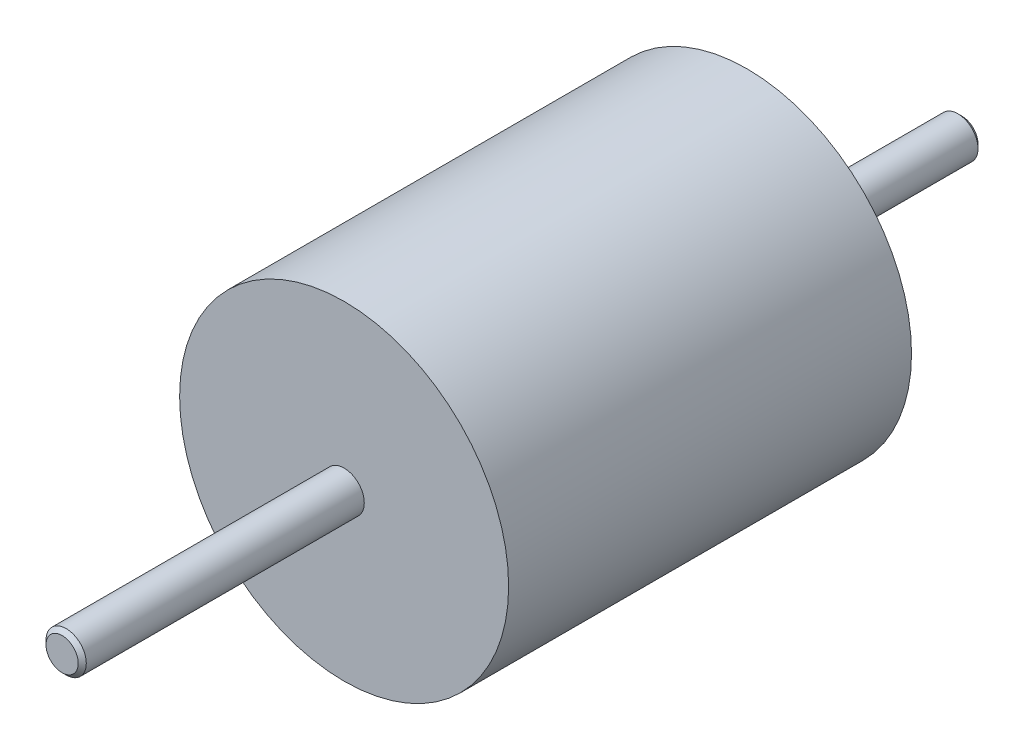
ISO-10303-21;
HEADER;
FILE_DESCRIPTION(('STEP AP214'),'2;1');
FILE_NAME('part.step','',(''),(''),'','','');
FILE_SCHEMA(('AUTOMOTIVE_DESIGN { 1 0 10303 214 1 1 1 1 }'));
ENDSEC;
DATA;
#1=APPLICATION_CONTEXT('core data for automotive mechanical design processes');
#2=APPLICATION_PROTOCOL_DEFINITION('international standard','automotive_design',2000,#1);
#3=PRODUCT_CONTEXT('',#1,'mechanical');
#4=PRODUCT('Part','Part','',(#3));
#5=PRODUCT_RELATED_PRODUCT_CATEGORY('part','',(#4));
#6=PRODUCT_DEFINITION_FORMATION('','',#4);
#7=PRODUCT_DEFINITION_CONTEXT('part definition',#1,'design');
#8=PRODUCT_DEFINITION('design','',#6,#7);
#9=PRODUCT_DEFINITION_SHAPE('','',#8);
#10=(LENGTH_UNIT() NAMED_UNIT(*) SI_UNIT(.MILLI.,.METRE.));
#11=(NAMED_UNIT(*) PLANE_ANGLE_UNIT() SI_UNIT($,.RADIAN.));
#12=(NAMED_UNIT(*) SI_UNIT($,.STERADIAN.) SOLID_ANGLE_UNIT());
#13=UNCERTAINTY_MEASURE_WITH_UNIT(LENGTH_MEASURE(1.E-05),#10,'distance_accuracy_value','');
#14=(GEOMETRIC_REPRESENTATION_CONTEXT(3) GLOBAL_UNCERTAINTY_ASSIGNED_CONTEXT((#13)) GLOBAL_UNIT_ASSIGNED_CONTEXT((#10,
#11,#12)) REPRESENTATION_CONTEXT('',''));
#15=CARTESIAN_POINT('',(0.,0.,0.));
#16=DIRECTION('',(0.,0.,1.));
#17=DIRECTION('',(1.,0.,0.));
#18=AXIS2_PLACEMENT_3D('',#15,#16,#17);
#19=CARTESIAN_POINT('',(0.,0.,33.5));
#20=DIRECTION('',(0.,0.,-1.));
#21=DIRECTION('',(-1.,0.,0.));
#22=AXIS2_PLACEMENT_3D('',#19,#20,#21);
#23=CYLINDRICAL_SURFACE('',#22,1.5);
#24=CARTESIAN_POINT('',(0.,0.,-33.2));
#25=DIRECTION('',(0.,0.,1.));
#26=DIRECTION('',(1.,0.,0.));
#27=AXIS2_PLACEMENT_3D('',#24,#25,#26);
#28=CIRCLE('',#27,1.5);
#29=CARTESIAN_POINT('',(1.5,0.,-33.2));
#30=VERTEX_POINT('',#29);
#31=EDGE_CURVE('E57',#30,#30,#28,.T.);
#32=ORIENTED_EDGE('',*,*,#31,.T.);
#33=EDGE_LOOP('',(#32));
#34=FACE_BOUND('',#33,.T.);
#35=CARTESIAN_POINT('',(0.,0.,-17.5));
#36=DIRECTION('',(0.,0.,1.));
#37=DIRECTION('',(1.,0.,0.));
#38=AXIS2_PLACEMENT_3D('',#35,#36,#37);
#39=CIRCLE('',#38,1.5);
#40=CARTESIAN_POINT('',(1.5,0.,-17.5));
#41=VERTEX_POINT('',#40);
#42=EDGE_CURVE('E62',#41,#41,#39,.T.);
#43=ORIENTED_EDGE('',*,*,#42,.F.);
#44=EDGE_LOOP('',(#43));
#45=FACE_BOUND('',#44,.T.);
#46=ADVANCED_FACE('F41',(#34,#45),#23,.T.);
#47=CARTESIAN_POINT('',(0.,0.,-33.5));
#48=DIRECTION('',(0.,0.,1.));
#49=DIRECTION('',(1.,0.,0.));
#50=AXIS2_PLACEMENT_3D('',#47,#48,#49);
#51=PLANE('',#50);
#52=CARTESIAN_POINT('',(0.,0.,-33.5));
#53=DIRECTION('',(0.,0.,1.));
#54=DIRECTION('',(1.,0.,0.));
#55=AXIS2_PLACEMENT_3D('',#52,#53,#54);
#56=CIRCLE('',#55,1.2);
#57=CARTESIAN_POINT('',(1.2,0.,-33.5));
#58=VERTEX_POINT('',#57);
#59=EDGE_CURVE('E53',#58,#58,#56,.F.);
#60=ORIENTED_EDGE('',*,*,#59,.T.);
#61=EDGE_LOOP('',(#60));
#62=FACE_BOUND('',#61,.T.);
#63=ADVANCED_FACE('F87',(#62),#51,.F.);
#64=CARTESIAN_POINT('',(0.,0.,-17.5));
#65=DIRECTION('',(0.,0.,1.));
#66=DIRECTION('',(1.,0.,0.));
#67=AXIS2_PLACEMENT_3D('',#64,#65,#66);
#68=CYLINDRICAL_SURFACE('',#67,12.25);
#69=CARTESIAN_POINT('',(0.,0.,-17.5));
#70=DIRECTION('',(0.,0.,1.));
#71=DIRECTION('',(1.,0.,0.));
#72=AXIS2_PLACEMENT_3D('',#69,#70,#71);
#73=CIRCLE('',#72,12.25);
#74=CARTESIAN_POINT('',(12.25,0.,-17.5));
#75=VERTEX_POINT('',#74);
#76=EDGE_CURVE('E65',#75,#75,#73,.T.);
#77=ORIENTED_EDGE('',*,*,#76,.T.);
#78=EDGE_LOOP('',(#77));
#79=FACE_BOUND('',#78,.T.);
#80=CARTESIAN_POINT('',(0.,0.,12.5));
#81=DIRECTION('',(0.,0.,1.));
#82=DIRECTION('',(1.,0.,0.));
#83=AXIS2_PLACEMENT_3D('',#80,#81,#82);
#84=CIRCLE('',#83,12.25);
#85=CARTESIAN_POINT('',(12.25,0.,12.5));
#86=VERTEX_POINT('',#85);
#87=EDGE_CURVE('E66',#86,#86,#84,.T.);
#88=ORIENTED_EDGE('',*,*,#87,.F.);
#89=EDGE_LOOP('',(#88));
#90=FACE_BOUND('',#89,.T.);
#91=ADVANCED_FACE('F85',(#79,#90),#68,.T.);
#92=CARTESIAN_POINT('',(0.,0.,-17.5));
#93=DIRECTION('',(0.,0.,1.));
#94=DIRECTION('',(1.,0.,0.));
#95=AXIS2_PLACEMENT_3D('',#92,#93,#94);
#96=PLANE('',#95);
#97=ORIENTED_EDGE('',*,*,#42,.T.);
#98=EDGE_LOOP('',(#97));
#99=FACE_BOUND('',#98,.T.);
#100=ORIENTED_EDGE('',*,*,#76,.F.);
#101=EDGE_LOOP('',(#100));
#102=FACE_BOUND('',#101,.T.);
#103=ADVANCED_FACE('F81',(#99,#102),#96,.F.);
#104=CARTESIAN_POINT('',(0.,0.,12.5));
#105=DIRECTION('',(0.,0.,1.));
#106=DIRECTION('',(1.,0.,0.));
#107=AXIS2_PLACEMENT_3D('',#104,#105,#106);
#108=PLANE('',#107);
#109=CARTESIAN_POINT('',(0.,0.,12.5));
#110=DIRECTION('',(0.,0.,1.));
#111=DIRECTION('',(1.,0.,0.));
#112=AXIS2_PLACEMENT_3D('',#109,#110,#111);
#113=CIRCLE('',#112,1.5);
#114=CARTESIAN_POINT('',(1.5,0.,12.5));
#115=VERTEX_POINT('',#114);
#116=EDGE_CURVE('E69',#115,#115,#113,.T.);
#117=ORIENTED_EDGE('',*,*,#116,.F.);
#118=EDGE_LOOP('',(#117));
#119=FACE_BOUND('',#118,.T.);
#120=ORIENTED_EDGE('',*,*,#87,.T.);
#121=EDGE_LOOP('',(#120));
#122=FACE_BOUND('',#121,.T.);
#123=ADVANCED_FACE('F77',(#119,#122),#108,.T.);
#124=CARTESIAN_POINT('',(0.,0.,33.5));
#125=DIRECTION('',(0.,0.,1.));
#126=DIRECTION('',(1.,0.,0.));
#127=AXIS2_PLACEMENT_3D('',#124,#125,#126);
#128=PLANE('',#127);
#129=CARTESIAN_POINT('',(0.,0.,33.5));
#130=DIRECTION('',(0.,0.,1.));
#131=DIRECTION('',(1.,0.,0.));
#132=AXIS2_PLACEMENT_3D('',#129,#130,#131);
#133=CIRCLE('',#132,1.2);
#134=CARTESIAN_POINT('',(1.2,0.,33.5));
#135=VERTEX_POINT('',#134);
#136=EDGE_CURVE('E49',#135,#135,#133,.T.);
#137=ORIENTED_EDGE('',*,*,#136,.T.);
#138=EDGE_LOOP('',(#137));
#139=FACE_BOUND('',#138,.T.);
#140=ADVANCED_FACE('F80',(#139),#128,.T.);
#141=CARTESIAN_POINT('',(0.,0.,33.2));
#142=DIRECTION('',(0.,0.,1.));
#143=DIRECTION('',(1.,0.,0.));
#144=AXIS2_PLACEMENT_3D('',#141,#142,#143);
#145=CIRCLE('',#144,1.5);
#146=CARTESIAN_POINT('',(1.5,0.,33.2));
#147=VERTEX_POINT('',#146);
#148=EDGE_CURVE('E10',#147,#147,#145,.F.);
#149=ORIENTED_EDGE('',*,*,#148,.T.);
#150=EDGE_LOOP('',(#149));
#151=FACE_BOUND('',#150,.T.);
#152=ORIENTED_EDGE('',*,*,#116,.T.);
#153=EDGE_LOOP('',(#152));
#154=FACE_BOUND('',#153,.T.);
#155=ADVANCED_FACE('F75',(#151,#154),#23,.T.);
#156=CARTESIAN_POINT('',(0.,0.,-33.2));
#157=DIRECTION('',(0.,0.,1.));
#158=DIRECTION('',(1.,0.,0.));
#159=AXIS2_PLACEMENT_3D('',#156,#157,#158);
#160=CONICAL_SURFACE('',#159,1.5,0.785398163397435);
#161=ORIENTED_EDGE('',*,*,#59,.F.);
#162=EDGE_LOOP('',(#161));
#163=FACE_BOUND('',#162,.T.);
#164=ORIENTED_EDGE('',*,*,#31,.F.);
#165=EDGE_LOOP('',(#164));
#166=FACE_BOUND('',#165,.T.);
#167=ADVANCED_FACE('F106',(#163,#166),#160,.T.);
#168=CARTESIAN_POINT('',(0.,0.,33.5));
#169=DIRECTION('',(0.,0.,-1.));
#170=DIRECTION('',(-1.,0.,0.));
#171=AXIS2_PLACEMENT_3D('',#168,#169,#170);
#172=CONICAL_SURFACE('',#171,1.2,0.785398163397435);
#173=ORIENTED_EDGE('',*,*,#148,.F.);
#174=EDGE_LOOP('',(#173));
#175=FACE_BOUND('',#174,.T.);
#176=ORIENTED_EDGE('',*,*,#136,.F.);
#177=EDGE_LOOP('',(#176));
#178=FACE_BOUND('',#177,.T.);
#179=ADVANCED_FACE('F44',(#175,#178),#172,.T.);
#180=CLOSED_SHELL('',(#46,#63,#91,#103,#123,#140,#155,#167,#179));
#181=MANIFOLD_SOLID_BREP('B2',#180);
#182=ADVANCED_BREP_SHAPE_REPRESENTATION('',(#18,#181),#14);
#183=SHAPE_DEFINITION_REPRESENTATION(#9,#182);
ENDSEC;
END-ISO-10303-21;
